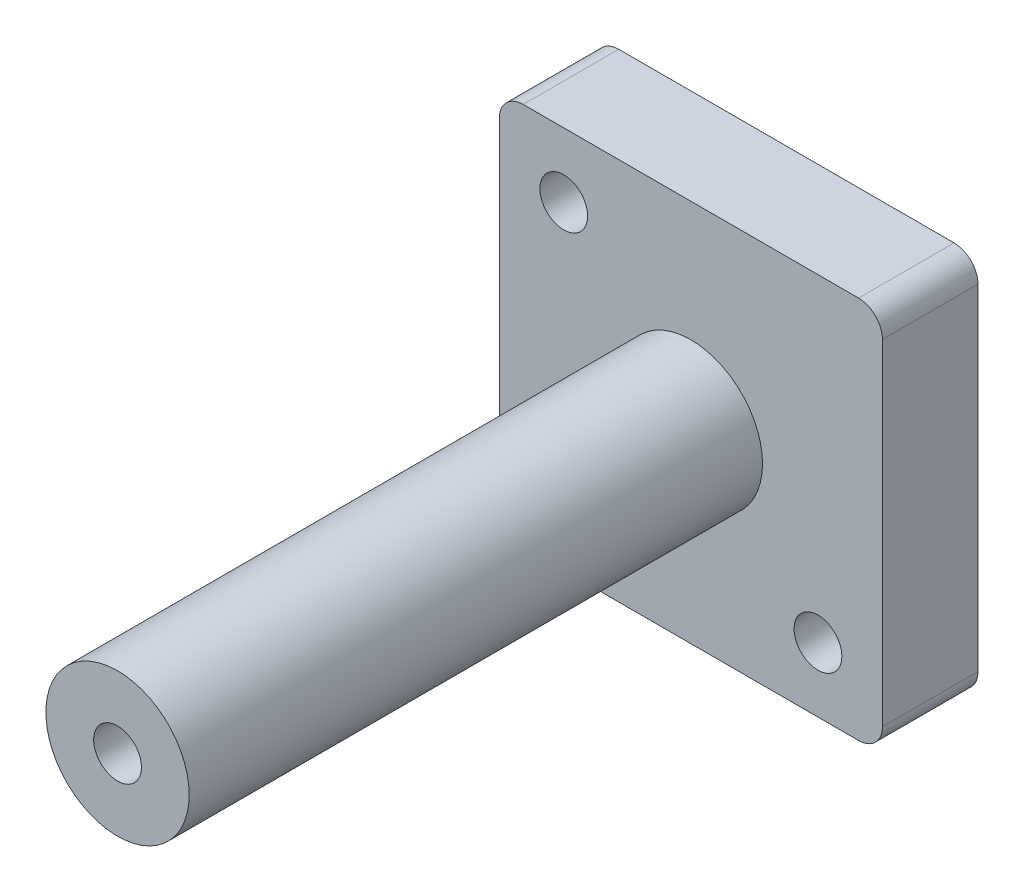
ISO-10303-21;
HEADER;
FILE_DESCRIPTION(('STEP AP214'),'2;1');
FILE_NAME('part.step','',(''),(''),'','','');
FILE_SCHEMA(('AUTOMOTIVE_DESIGN { 1 0 10303 214 1 1 1 1 }'));
ENDSEC;
DATA;
#1=APPLICATION_CONTEXT('core data for automotive mechanical design processes');
#2=APPLICATION_PROTOCOL_DEFINITION('international standard','automotive_design',2000,#1);
#3=PRODUCT_CONTEXT('',#1,'mechanical');
#4=PRODUCT('Part','Part','',(#3));
#5=PRODUCT_RELATED_PRODUCT_CATEGORY('part','',(#4));
#6=PRODUCT_DEFINITION_FORMATION('','',#4);
#7=PRODUCT_DEFINITION_CONTEXT('part definition',#1,'design');
#8=PRODUCT_DEFINITION('design','',#6,#7);
#9=PRODUCT_DEFINITION_SHAPE('','',#8);
#10=(LENGTH_UNIT() NAMED_UNIT(*) SI_UNIT(.MILLI.,.METRE.));
#11=(NAMED_UNIT(*) PLANE_ANGLE_UNIT() SI_UNIT($,.RADIAN.));
#12=(NAMED_UNIT(*) SI_UNIT($,.STERADIAN.) SOLID_ANGLE_UNIT());
#13=UNCERTAINTY_MEASURE_WITH_UNIT(LENGTH_MEASURE(1.E-05),#10,'distance_accuracy_value','');
#14=(GEOMETRIC_REPRESENTATION_CONTEXT(3) GLOBAL_UNCERTAINTY_ASSIGNED_CONTEXT((#13)) GLOBAL_UNIT_ASSIGNED_CONTEXT((#10,
#11,#12)) REPRESENTATION_CONTEXT('',''));
#15=CARTESIAN_POINT('',(0.,0.,0.));
#16=DIRECTION('',(0.,0.,1.));
#17=DIRECTION('',(1.,0.,0.));
#18=AXIS2_PLACEMENT_3D('',#15,#16,#17);
#19=CARTESIAN_POINT('',(2.5,2.5,10.));
#20=DIRECTION('',(0.,0.,-1.));
#21=DIRECTION('',(-1.,0.,0.));
#22=AXIS2_PLACEMENT_3D('',#19,#20,#21);
#23=PLANE('',#22);
#24=CARTESIAN_POINT('',(20.05,20.05,10.));
#25=DIRECTION('',(0.,0.,1.));
#26=DIRECTION('',(1.,0.,0.));
#27=AXIS2_PLACEMENT_3D('',#24,#25,#26);
#28=CIRCLE('',#27,7.5);
#29=CARTESIAN_POINT('',(27.55,20.05,10.));
#30=VERTEX_POINT('',#29);
#31=EDGE_CURVE('E11',#30,#30,#28,.T.);
#32=ORIENTED_EDGE('',*,*,#31,.F.);
#33=EDGE_LOOP('',(#32));
#34=FACE_BOUND('',#33,.T.);
#35=CARTESIAN_POINT('',(2.5,2.5,10.));
#36=DIRECTION('',(0.,0.,1.));
#37=DIRECTION('',(-1.,0.,0.));
#38=AXIS2_PLACEMENT_3D('',#35,#36,#37);
#39=CIRCLE('',#38,2.5);
#40=CARTESIAN_POINT('',(0.,2.50000000000002,10.));
#41=VERTEX_POINT('',#40);
#42=CARTESIAN_POINT('',(2.50000000000002,0.,10.));
#43=VERTEX_POINT('',#42);
#44=EDGE_CURVE('E172',#41,#43,#39,.T.);
#45=ORIENTED_EDGE('',*,*,#44,.T.);
#46=DIRECTION('',(1.,0.,0.));
#47=VECTOR('',#46,1.);
#48=CARTESIAN_POINT('',(2.50000000000002,0.,10.));
#49=LINE('',#48,#47);
#50=CARTESIAN_POINT('',(37.6,0.,10.));
#51=VERTEX_POINT('',#50);
#52=EDGE_CURVE('E108',#43,#51,#49,.T.);
#53=ORIENTED_EDGE('',*,*,#52,.T.);
#54=CARTESIAN_POINT('',(37.6,2.5,10.));
#55=DIRECTION('',(0.,0.,1.));
#56=DIRECTION('',(1.,0.,0.));
#57=AXIS2_PLACEMENT_3D('',#54,#55,#56);
#58=CIRCLE('',#57,2.5);
#59=CARTESIAN_POINT('',(40.1,2.5,10.));
#60=VERTEX_POINT('',#59);
#61=EDGE_CURVE('E211',#51,#60,#58,.T.);
#62=ORIENTED_EDGE('',*,*,#61,.T.);
#63=DIRECTION('',(0.,1.,0.));
#64=VECTOR('',#63,1.);
#65=CARTESIAN_POINT('',(40.1,2.5,10.));
#66=LINE('',#65,#64);
#67=CARTESIAN_POINT('',(40.1,37.6,10.));
#68=VERTEX_POINT('',#67);
#69=EDGE_CURVE('E209',#60,#68,#66,.T.);
#70=ORIENTED_EDGE('',*,*,#69,.T.);
#71=CARTESIAN_POINT('',(37.6,37.6,10.));
#72=DIRECTION('',(0.,0.,1.));
#73=DIRECTION('',(-1.,0.,0.));
#74=AXIS2_PLACEMENT_3D('',#71,#72,#73);
#75=CIRCLE('',#74,2.5);
#76=CARTESIAN_POINT('',(37.6,40.1,10.));
#77=VERTEX_POINT('',#76);
#78=EDGE_CURVE('E127',#68,#77,#75,.T.);
#79=ORIENTED_EDGE('',*,*,#78,.T.);
#80=DIRECTION('',(-1.,0.,0.));
#81=VECTOR('',#80,1.);
#82=CARTESIAN_POINT('',(2.5,40.1,10.));
#83=LINE('',#82,#81);
#84=CARTESIAN_POINT('',(2.5,40.1,10.));
#85=VERTEX_POINT('',#84);
#86=EDGE_CURVE('E121',#77,#85,#83,.T.);
#87=ORIENTED_EDGE('',*,*,#86,.T.);
#88=CARTESIAN_POINT('',(2.5,37.6,10.));
#89=DIRECTION('',(0.,0.,1.));
#90=DIRECTION('',(-1.,0.,0.));
#91=AXIS2_PLACEMENT_3D('',#88,#89,#90);
#92=CIRCLE('',#91,2.5);
#93=CARTESIAN_POINT('',(0.,37.6,10.));
#94=VERTEX_POINT('',#93);
#95=EDGE_CURVE('E125',#85,#94,#92,.T.);
#96=ORIENTED_EDGE('',*,*,#95,.T.);
#97=DIRECTION('',(0.,-1.,0.));
#98=VECTOR('',#97,1.);
#99=CARTESIAN_POINT('',(0.,2.50000000000002,10.));
#100=LINE('',#99,#98);
#101=EDGE_CURVE('E64',#94,#41,#100,.T.);
#102=ORIENTED_EDGE('',*,*,#101,.T.);
#103=EDGE_LOOP('',(#45,#53,#62,#70,#79,#87,#96,#102));
#104=FACE_BOUND('',#103,.T.);
#105=CARTESIAN_POINT('',(6.75,33.35,10.));
#106=DIRECTION('',(0.,0.,1.));
#107=DIRECTION('',(1.,0.,0.));
#108=AXIS2_PLACEMENT_3D('',#105,#106,#107);
#109=CIRCLE('',#108,2.5);
#110=CARTESIAN_POINT('',(9.25,33.35,10.));
#111=VERTEX_POINT('',#110);
#112=EDGE_CURVE('E154',#111,#111,#109,.T.);
#113=ORIENTED_EDGE('',*,*,#112,.F.);
#114=EDGE_LOOP('',(#113));
#115=FACE_BOUND('',#114,.T.);
#116=CARTESIAN_POINT('',(33.35,6.75,10.));
#117=DIRECTION('',(0.,0.,1.));
#118=DIRECTION('',(1.,0.,0.));
#119=AXIS2_PLACEMENT_3D('',#116,#117,#118);
#120=CIRCLE('',#119,2.5);
#121=CARTESIAN_POINT('',(35.85,6.75,10.));
#122=VERTEX_POINT('',#121);
#123=EDGE_CURVE('E225',#122,#122,#120,.T.);
#124=ORIENTED_EDGE('',*,*,#123,.F.);
#125=EDGE_LOOP('',(#124));
#126=FACE_BOUND('',#125,.T.);
#127=ADVANCED_FACE('F45',(#34,#104,#115,#126),#23,.F.);
#128=CARTESIAN_POINT('',(2.5,2.5,0.));
#129=DIRECTION('',(0.,0.,-1.));
#130=DIRECTION('',(-1.,0.,0.));
#131=AXIS2_PLACEMENT_3D('',#128,#129,#130);
#132=PLANE('',#131);
#133=CARTESIAN_POINT('',(6.75,33.35,0.));
#134=DIRECTION('',(0.,0.,1.));
#135=DIRECTION('',(1.,0.,0.));
#136=AXIS2_PLACEMENT_3D('',#133,#134,#135);
#137=CIRCLE('',#136,2.5);
#138=CARTESIAN_POINT('',(9.25,33.35,0.));
#139=VERTEX_POINT('',#138);
#140=EDGE_CURVE('E221',#139,#139,#137,.T.);
#141=ORIENTED_EDGE('',*,*,#140,.T.);
#142=EDGE_LOOP('',(#141));
#143=FACE_BOUND('',#142,.T.);
#144=CARTESIAN_POINT('',(2.5,2.5,0.));
#145=DIRECTION('',(0.,0.,1.));
#146=DIRECTION('',(-1.,0.,0.));
#147=AXIS2_PLACEMENT_3D('',#144,#145,#146);
#148=CIRCLE('',#147,2.5);
#149=CARTESIAN_POINT('',(0.,2.50000000000002,0.));
#150=VERTEX_POINT('',#149);
#151=CARTESIAN_POINT('',(2.50000000000002,0.,0.));
#152=VERTEX_POINT('',#151);
#153=EDGE_CURVE('E149',#150,#152,#148,.T.);
#154=ORIENTED_EDGE('',*,*,#153,.F.);
#155=DIRECTION('',(0.,-1.,0.));
#156=VECTOR('',#155,1.);
#157=CARTESIAN_POINT('',(0.,2.50000000000002,0.));
#158=LINE('',#157,#156);
#159=CARTESIAN_POINT('',(0.,37.6,0.));
#160=VERTEX_POINT('',#159);
#161=EDGE_CURVE('E99',#160,#150,#158,.T.);
#162=ORIENTED_EDGE('',*,*,#161,.F.);
#163=CARTESIAN_POINT('',(2.5,37.6,0.));
#164=DIRECTION('',(0.,0.,1.));
#165=DIRECTION('',(-1.,0.,0.));
#166=AXIS2_PLACEMENT_3D('',#163,#164,#165);
#167=CIRCLE('',#166,2.5);
#168=CARTESIAN_POINT('',(2.5,40.1,0.));
#169=VERTEX_POINT('',#168);
#170=EDGE_CURVE('E93',#169,#160,#167,.T.);
#171=ORIENTED_EDGE('',*,*,#170,.F.);
#172=DIRECTION('',(-1.,0.,0.));
#173=VECTOR('',#172,1.);
#174=CARTESIAN_POINT('',(2.5,40.1,0.));
#175=LINE('',#174,#173);
#176=CARTESIAN_POINT('',(37.6,40.1,0.));
#177=VERTEX_POINT('',#176);
#178=EDGE_CURVE('E136',#177,#169,#175,.T.);
#179=ORIENTED_EDGE('',*,*,#178,.F.);
#180=CARTESIAN_POINT('',(37.6,37.6,0.));
#181=DIRECTION('',(0.,0.,1.));
#182=DIRECTION('',(-1.,0.,0.));
#183=AXIS2_PLACEMENT_3D('',#180,#181,#182);
#184=CIRCLE('',#183,2.5);
#185=CARTESIAN_POINT('',(40.1,37.6,0.));
#186=VERTEX_POINT('',#185);
#187=EDGE_CURVE('E163',#186,#177,#184,.T.);
#188=ORIENTED_EDGE('',*,*,#187,.F.);
#189=DIRECTION('',(0.,1.,0.));
#190=VECTOR('',#189,1.);
#191=CARTESIAN_POINT('',(40.1,2.5,0.));
#192=LINE('',#191,#190);
#193=CARTESIAN_POINT('',(40.1,2.5,0.));
#194=VERTEX_POINT('',#193);
#195=EDGE_CURVE('E160',#194,#186,#192,.T.);
#196=ORIENTED_EDGE('',*,*,#195,.F.);
#197=CARTESIAN_POINT('',(37.6,2.5,0.));
#198=DIRECTION('',(0.,0.,1.));
#199=DIRECTION('',(1.,0.,0.));
#200=AXIS2_PLACEMENT_3D('',#197,#198,#199);
#201=CIRCLE('',#200,2.5);
#202=CARTESIAN_POINT('',(37.6,0.,0.));
#203=VERTEX_POINT('',#202);
#204=EDGE_CURVE('E157',#203,#194,#201,.T.);
#205=ORIENTED_EDGE('',*,*,#204,.F.);
#206=DIRECTION('',(1.,0.,0.));
#207=VECTOR('',#206,1.);
#208=CARTESIAN_POINT('',(2.50000000000002,0.,0.));
#209=LINE('',#208,#207);
#210=EDGE_CURVE('E153',#152,#203,#209,.T.);
#211=ORIENTED_EDGE('',*,*,#210,.F.);
#212=EDGE_LOOP('',(#154,#162,#171,#179,#188,#196,#205,#211));
#213=FACE_BOUND('',#212,.T.);
#214=CARTESIAN_POINT('',(33.35,6.75,0.));
#215=DIRECTION('',(0.,0.,1.));
#216=DIRECTION('',(1.,0.,0.));
#217=AXIS2_PLACEMENT_3D('',#214,#215,#216);
#218=CIRCLE('',#217,2.5);
#219=CARTESIAN_POINT('',(35.85,6.75,0.));
#220=VERTEX_POINT('',#219);
#221=EDGE_CURVE('E229',#220,#220,#218,.T.);
#222=ORIENTED_EDGE('',*,*,#221,.T.);
#223=EDGE_LOOP('',(#222));
#224=FACE_BOUND('',#223,.T.);
#225=ADVANCED_FACE('F199',(#143,#213,#224),#132,.T.);
#226=CARTESIAN_POINT('',(2.5,2.5,10.));
#227=DIRECTION('',(0.,0.,-1.));
#228=DIRECTION('',(-1.,0.,0.));
#229=AXIS2_PLACEMENT_3D('',#226,#227,#228);
#230=CYLINDRICAL_SURFACE('',#229,2.5);
#231=ORIENTED_EDGE('',*,*,#153,.T.);
#232=DIRECTION('',(0.,0.,-1.));
#233=VECTOR('',#232,1.);
#234=CARTESIAN_POINT('',(2.50000000000002,0.,10.));
#235=LINE('',#234,#233);
#236=EDGE_CURVE('E49',#43,#152,#235,.T.);
#237=ORIENTED_EDGE('',*,*,#236,.F.);
#238=ORIENTED_EDGE('',*,*,#44,.F.);
#239=DIRECTION('',(0.,0.,-1.));
#240=VECTOR('',#239,1.);
#241=CARTESIAN_POINT('',(0.,2.50000000000002,10.));
#242=LINE('',#241,#240);
#243=EDGE_CURVE('E145',#41,#150,#242,.T.);
#244=ORIENTED_EDGE('',*,*,#243,.T.);
#245=EDGE_LOOP('',(#231,#237,#238,#244));
#246=FACE_BOUND('',#245,.T.);
#247=ADVANCED_FACE('F47',(#246),#230,.T.);
#248=CARTESIAN_POINT('',(2.50000000000002,0.,10.));
#249=DIRECTION('',(0.,1.,0.));
#250=DIRECTION('',(0.,0.,1.));
#251=AXIS2_PLACEMENT_3D('',#248,#249,#250);
#252=PLANE('',#251);
#253=ORIENTED_EDGE('',*,*,#210,.T.);
#254=DIRECTION('',(0.,0.,-1.));
#255=VECTOR('',#254,1.);
#256=CARTESIAN_POINT('',(37.6,0.,10.));
#257=LINE('',#256,#255);
#258=EDGE_CURVE('E186',#51,#203,#257,.T.);
#259=ORIENTED_EDGE('',*,*,#258,.F.);
#260=ORIENTED_EDGE('',*,*,#52,.F.);
#261=ORIENTED_EDGE('',*,*,#236,.T.);
#262=EDGE_LOOP('',(#253,#259,#260,#261));
#263=FACE_BOUND('',#262,.T.);
#264=ADVANCED_FACE('F194',(#263),#252,.F.);
#265=CARTESIAN_POINT('',(37.6,2.5,10.));
#266=DIRECTION('',(0.,0.,-1.));
#267=DIRECTION('',(-1.,0.,0.));
#268=AXIS2_PLACEMENT_3D('',#265,#266,#267);
#269=CYLINDRICAL_SURFACE('',#268,2.5);
#270=ORIENTED_EDGE('',*,*,#204,.T.);
#271=DIRECTION('',(0.,0.,-1.));
#272=VECTOR('',#271,1.);
#273=CARTESIAN_POINT('',(40.1,2.5,10.));
#274=LINE('',#273,#272);
#275=EDGE_CURVE('E183',#60,#194,#274,.T.);
#276=ORIENTED_EDGE('',*,*,#275,.F.);
#277=ORIENTED_EDGE('',*,*,#61,.F.);
#278=ORIENTED_EDGE('',*,*,#258,.T.);
#279=EDGE_LOOP('',(#270,#276,#277,#278));
#280=FACE_BOUND('',#279,.T.);
#281=ADVANCED_FACE('F204',(#280),#269,.T.);
#282=CARTESIAN_POINT('',(40.1,2.5,10.));
#283=DIRECTION('',(-1.,0.,0.));
#284=DIRECTION('',(0.,0.,1.));
#285=AXIS2_PLACEMENT_3D('',#282,#283,#284);
#286=PLANE('',#285);
#287=ORIENTED_EDGE('',*,*,#195,.T.);
#288=DIRECTION('',(0.,0.,-1.));
#289=VECTOR('',#288,1.);
#290=CARTESIAN_POINT('',(40.1,37.6,10.));
#291=LINE('',#290,#289);
#292=EDGE_CURVE('E179',#68,#186,#291,.T.);
#293=ORIENTED_EDGE('',*,*,#292,.F.);
#294=ORIENTED_EDGE('',*,*,#69,.F.);
#295=ORIENTED_EDGE('',*,*,#275,.T.);
#296=EDGE_LOOP('',(#287,#293,#294,#295));
#297=FACE_BOUND('',#296,.T.);
#298=ADVANCED_FACE('F207',(#297),#286,.F.);
#299=CARTESIAN_POINT('',(37.6,37.6,10.));
#300=DIRECTION('',(0.,0.,-1.));
#301=DIRECTION('',(-1.,0.,0.));
#302=AXIS2_PLACEMENT_3D('',#299,#300,#301);
#303=CYLINDRICAL_SURFACE('',#302,2.5);
#304=ORIENTED_EDGE('',*,*,#187,.T.);
#305=DIRECTION('',(0.,0.,-1.));
#306=VECTOR('',#305,1.);
#307=CARTESIAN_POINT('',(37.6,40.1,10.));
#308=LINE('',#307,#306);
#309=EDGE_CURVE('E138',#77,#177,#308,.T.);
#310=ORIENTED_EDGE('',*,*,#309,.F.);
#311=ORIENTED_EDGE('',*,*,#78,.F.);
#312=ORIENTED_EDGE('',*,*,#292,.T.);
#313=EDGE_LOOP('',(#304,#310,#311,#312));
#314=FACE_BOUND('',#313,.T.);
#315=ADVANCED_FACE('F289',(#314),#303,.T.);
#316=CARTESIAN_POINT('',(2.5,40.1,10.));
#317=DIRECTION('',(0.,-1.,0.));
#318=DIRECTION('',(0.,0.,-1.));
#319=AXIS2_PLACEMENT_3D('',#316,#317,#318);
#320=PLANE('',#319);
#321=ORIENTED_EDGE('',*,*,#178,.T.);
#322=DIRECTION('',(0.,0.,-1.));
#323=VECTOR('',#322,1.);
#324=CARTESIAN_POINT('',(2.5,40.1,10.));
#325=LINE('',#324,#323);
#326=EDGE_CURVE('E133',#85,#169,#325,.T.);
#327=ORIENTED_EDGE('',*,*,#326,.F.);
#328=ORIENTED_EDGE('',*,*,#86,.F.);
#329=ORIENTED_EDGE('',*,*,#309,.T.);
#330=EDGE_LOOP('',(#321,#327,#328,#329));
#331=FACE_BOUND('',#330,.T.);
#332=ADVANCED_FACE('F134',(#331),#320,.F.);
#333=CARTESIAN_POINT('',(2.5,37.6,10.));
#334=DIRECTION('',(0.,0.,-1.));
#335=DIRECTION('',(-1.,0.,0.));
#336=AXIS2_PLACEMENT_3D('',#333,#334,#335);
#337=CYLINDRICAL_SURFACE('',#336,2.5);
#338=ORIENTED_EDGE('',*,*,#170,.T.);
#339=DIRECTION('',(0.,0.,-1.));
#340=VECTOR('',#339,1.);
#341=CARTESIAN_POINT('',(0.,37.6,10.));
#342=LINE('',#341,#340);
#343=EDGE_CURVE('E139',#94,#160,#342,.T.);
#344=ORIENTED_EDGE('',*,*,#343,.F.);
#345=ORIENTED_EDGE('',*,*,#95,.F.);
#346=ORIENTED_EDGE('',*,*,#326,.T.);
#347=EDGE_LOOP('',(#338,#344,#345,#346));
#348=FACE_BOUND('',#347,.T.);
#349=ADVANCED_FACE('F141',(#348),#337,.T.);
#350=CARTESIAN_POINT('',(0.,2.50000000000002,10.));
#351=DIRECTION('',(1.,0.,0.));
#352=DIRECTION('',(0.,0.,-1.));
#353=AXIS2_PLACEMENT_3D('',#350,#351,#352);
#354=PLANE('',#353);
#355=ORIENTED_EDGE('',*,*,#161,.T.);
#356=ORIENTED_EDGE('',*,*,#243,.F.);
#357=ORIENTED_EDGE('',*,*,#101,.F.);
#358=ORIENTED_EDGE('',*,*,#343,.T.);
#359=EDGE_LOOP('',(#355,#356,#357,#358));
#360=FACE_BOUND('',#359,.T.);
#361=ADVANCED_FACE('F282',(#360),#354,.F.);
#362=CARTESIAN_POINT('',(6.75,33.35,10.));
#363=DIRECTION('',(0.,0.,-1.));
#364=DIRECTION('',(-1.,0.,0.));
#365=AXIS2_PLACEMENT_3D('',#362,#363,#364);
#366=CYLINDRICAL_SURFACE('',#365,2.5);
#367=ORIENTED_EDGE('',*,*,#112,.T.);
#368=EDGE_LOOP('',(#367));
#369=FACE_BOUND('',#368,.T.);
#370=ORIENTED_EDGE('',*,*,#140,.F.);
#371=EDGE_LOOP('',(#370));
#372=FACE_BOUND('',#371,.T.);
#373=ADVANCED_FACE('F279',(#369,#372),#366,.F.);
#374=CARTESIAN_POINT('',(33.35,6.75,10.));
#375=DIRECTION('',(0.,0.,-1.));
#376=DIRECTION('',(-1.,0.,0.));
#377=AXIS2_PLACEMENT_3D('',#374,#375,#376);
#378=CYLINDRICAL_SURFACE('',#377,2.5);
#379=ORIENTED_EDGE('',*,*,#123,.T.);
#380=EDGE_LOOP('',(#379));
#381=FACE_BOUND('',#380,.T.);
#382=ORIENTED_EDGE('',*,*,#221,.F.);
#383=EDGE_LOOP('',(#382));
#384=FACE_BOUND('',#383,.T.);
#385=ADVANCED_FACE('F266',(#381,#384),#378,.F.);
#386=CARTESIAN_POINT('',(20.05,20.05,70.));
#387=DIRECTION('',(0.,0.,-1.));
#388=DIRECTION('',(-1.,0.,0.));
#389=AXIS2_PLACEMENT_3D('',#386,#387,#388);
#390=CYLINDRICAL_SURFACE('',#389,7.5);
#391=CARTESIAN_POINT('',(20.05,20.05,70.));
#392=DIRECTION('',(0.,0.,1.));
#393=DIRECTION('',(1.,0.,0.));
#394=AXIS2_PLACEMENT_3D('',#391,#392,#393);
#395=CIRCLE('',#394,7.5);
#396=CARTESIAN_POINT('',(27.55,20.05,70.));
#397=VERTEX_POINT('',#396);
#398=EDGE_CURVE('E233',#397,#397,#395,.T.);
#399=ORIENTED_EDGE('',*,*,#398,.F.);
#400=EDGE_LOOP('',(#399));
#401=FACE_BOUND('',#400,.T.);
#402=ORIENTED_EDGE('',*,*,#31,.T.);
#403=EDGE_LOOP('',(#402));
#404=FACE_BOUND('',#403,.T.);
#405=ADVANCED_FACE('F260',(#401,#404),#390,.T.);
#406=CARTESIAN_POINT('',(20.05,20.05,70.));
#407=DIRECTION('',(0.,0.,1.));
#408=DIRECTION('',(1.,0.,0.));
#409=AXIS2_PLACEMENT_3D('',#406,#407,#408);
#410=PLANE('',#409);
#411=CARTESIAN_POINT('',(20.05,20.05,70.));
#412=DIRECTION('',(0.,0.,1.));
#413=DIRECTION('',(1.,0.,0.));
#414=AXIS2_PLACEMENT_3D('',#411,#412,#413);
#415=CIRCLE('',#414,2.5);
#416=CARTESIAN_POINT('',(22.55,20.05,70.));
#417=VERTEX_POINT('',#416);
#418=EDGE_CURVE('E241',#417,#417,#415,.T.);
#419=ORIENTED_EDGE('',*,*,#418,.F.);
#420=EDGE_LOOP('',(#419));
#421=FACE_BOUND('',#420,.T.);
#422=ORIENTED_EDGE('',*,*,#398,.T.);
#423=EDGE_LOOP('',(#422));
#424=FACE_BOUND('',#423,.T.);
#425=ADVANCED_FACE('F254',(#421,#424),#410,.T.);
#426=CARTESIAN_POINT('',(20.05,20.05,55.));
#427=DIRECTION('',(0.,0.,1.));
#428=DIRECTION('',(1.,0.,0.));
#429=AXIS2_PLACEMENT_3D('',#426,#427,#428);
#430=CYLINDRICAL_SURFACE('',#429,2.5);
#431=CARTESIAN_POINT('',(20.05,20.05,55.));
#432=DIRECTION('',(0.,0.,1.));
#433=DIRECTION('',(1.,0.,0.));
#434=AXIS2_PLACEMENT_3D('',#431,#432,#433);
#435=CIRCLE('',#434,2.5);
#436=CARTESIAN_POINT('',(22.55,20.05,55.));
#437=VERTEX_POINT('',#436);
#438=EDGE_CURVE('E240',#437,#437,#435,.T.);
#439=ORIENTED_EDGE('',*,*,#438,.F.);
#440=EDGE_LOOP('',(#439));
#441=FACE_BOUND('',#440,.T.);
#442=ORIENTED_EDGE('',*,*,#418,.T.);
#443=EDGE_LOOP('',(#442));
#444=FACE_BOUND('',#443,.T.);
#445=ADVANCED_FACE('F251',(#441,#444),#430,.F.);
#446=CARTESIAN_POINT('',(20.05,20.05,55.));
#447=DIRECTION('',(0.,0.,1.));
#448=DIRECTION('',(1.,0.,0.));
#449=AXIS2_PLACEMENT_3D('',#446,#447,#448);
#450=PLANE('',#449);
#451=ORIENTED_EDGE('',*,*,#438,.T.);
#452=EDGE_LOOP('',(#451));
#453=FACE_BOUND('',#452,.T.);
#454=ADVANCED_FACE('F249',(#453),#450,.T.);
#455=CLOSED_SHELL('',(#127,#225,#247,#264,#281,#298,#315,#332,#349,#361,#373,#385,#405,#425,
#445,#454));
#456=MANIFOLD_SOLID_BREP('B2',#455);
#457=ADVANCED_BREP_SHAPE_REPRESENTATION('',(#18,#456),#14);
#458=SHAPE_DEFINITION_REPRESENTATION(#9,#457);
ENDSEC;
END-ISO-10303-21;
